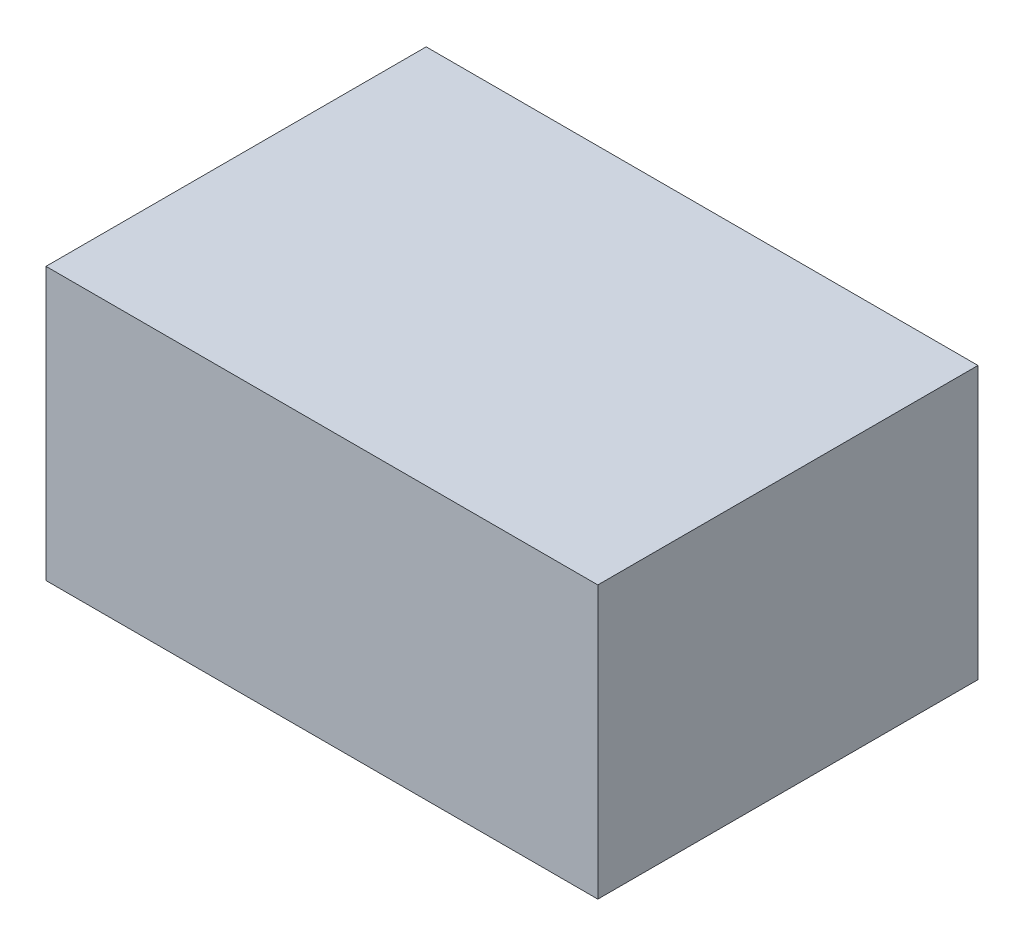
ISO-10303-21;
HEADER;
FILE_DESCRIPTION(('STEP AP214'),'2;1');
FILE_NAME('part.step','',(''),(''),'','','');
FILE_SCHEMA(('AUTOMOTIVE_DESIGN { 1 0 10303 214 1 1 1 1 }'));
ENDSEC;
DATA;
#1=APPLICATION_CONTEXT('core data for automotive mechanical design processes');
#2=APPLICATION_PROTOCOL_DEFINITION('international standard','automotive_design',2000,#1);
#3=PRODUCT_CONTEXT('',#1,'mechanical');
#4=PRODUCT('Part','Part','',(#3));
#5=PRODUCT_RELATED_PRODUCT_CATEGORY('part','',(#4));
#6=PRODUCT_DEFINITION_FORMATION('','',#4);
#7=PRODUCT_DEFINITION_CONTEXT('part definition',#1,'design');
#8=PRODUCT_DEFINITION('design','',#6,#7);
#9=PRODUCT_DEFINITION_SHAPE('','',#8);
#10=(LENGTH_UNIT() NAMED_UNIT(*) SI_UNIT(.MILLI.,.METRE.));
#11=(NAMED_UNIT(*) PLANE_ANGLE_UNIT() SI_UNIT($,.RADIAN.));
#12=(NAMED_UNIT(*) SI_UNIT($,.STERADIAN.) SOLID_ANGLE_UNIT());
#13=UNCERTAINTY_MEASURE_WITH_UNIT(LENGTH_MEASURE(1.E-05),#10,'distance_accuracy_value','');
#14=(GEOMETRIC_REPRESENTATION_CONTEXT(3) GLOBAL_UNCERTAINTY_ASSIGNED_CONTEXT((#13)) GLOBAL_UNIT_ASSIGNED_CONTEXT((#10,
#11,#12)) REPRESENTATION_CONTEXT('',''));
#15=CARTESIAN_POINT('',(0.,0.,0.));
#16=DIRECTION('',(0.,0.,1.));
#17=DIRECTION('',(1.,0.,0.));
#18=AXIS2_PLACEMENT_3D('',#15,#16,#17);
#19=CARTESIAN_POINT('',(0.91250008,-0.4499991,0.));
#20=DIRECTION('',(0.,-1.,0.));
#21=DIRECTION('',(0.,0.,-1.));
#22=AXIS2_PLACEMENT_3D('',#19,#20,#21);
#23=PLANE('',#22);
#24=DIRECTION('',(0.,0.,1.));
#25=VECTOR('',#24,1.);
#26=CARTESIAN_POINT('',(-0.91250008,-0.4499991,0.));
#27=LINE('',#26,#25);
#28=CARTESIAN_POINT('',(-0.91250008,-0.4499991,0.));
#29=VERTEX_POINT('',#28);
#30=CARTESIAN_POINT('',(-0.91250008,-0.4499991,1.2573));
#31=VERTEX_POINT('',#30);
#32=EDGE_CURVE('E19',#29,#31,#27,.T.);
#33=ORIENTED_EDGE('',*,*,#32,.F.);
#34=DIRECTION('',(1.,0.,0.));
#35=VECTOR('',#34,1.);
#36=CARTESIAN_POINT('',(-0.91250008,-0.4499991,0.));
#37=LINE('',#36,#35);
#38=CARTESIAN_POINT('',(0.91250008,-0.4499991,0.));
#39=VERTEX_POINT('',#38);
#40=EDGE_CURVE('E78',#29,#39,#37,.T.);
#41=ORIENTED_EDGE('',*,*,#40,.T.);
#42=DIRECTION('',(0.,0.,-1.));
#43=VECTOR('',#42,1.);
#44=CARTESIAN_POINT('',(0.91250008,-0.4499991,0.));
#45=LINE('',#44,#43);
#46=CARTESIAN_POINT('',(0.91250008,-0.4499991,1.2573));
#47=VERTEX_POINT('',#46);
#48=EDGE_CURVE('E60',#47,#39,#45,.T.);
#49=ORIENTED_EDGE('',*,*,#48,.F.);
#50=DIRECTION('',(1.,0.,0.));
#51=VECTOR('',#50,1.);
#52=CARTESIAN_POINT('',(-0.91250008,-0.4499991,1.2573));
#53=LINE('',#52,#51);
#54=EDGE_CURVE('E55',#31,#47,#53,.T.);
#55=ORIENTED_EDGE('',*,*,#54,.F.);
#56=EDGE_LOOP('',(#33,#41,#49,#55));
#57=FACE_BOUND('',#56,.T.);
#58=ADVANCED_FACE('F16',(#57),#23,.T.);
#59=CARTESIAN_POINT('',(-0.91250008,-0.4499991,0.));
#60=DIRECTION('',(-1.,0.,0.));
#61=DIRECTION('',(0.,0.,1.));
#62=AXIS2_PLACEMENT_3D('',#59,#60,#61);
#63=PLANE('',#62);
#64=DIRECTION('',(0.,0.,1.));
#65=VECTOR('',#64,1.);
#66=CARTESIAN_POINT('',(-0.91250008,0.45000164,0.));
#67=LINE('',#66,#65);
#68=CARTESIAN_POINT('',(-0.91250008,0.45000164,0.));
#69=VERTEX_POINT('',#68);
#70=CARTESIAN_POINT('',(-0.91250008,0.45000164,1.2573));
#71=VERTEX_POINT('',#70);
#72=EDGE_CURVE('E82',#69,#71,#67,.T.);
#73=ORIENTED_EDGE('',*,*,#72,.F.);
#74=DIRECTION('',(0.,1.,0.));
#75=VECTOR('',#74,1.);
#76=CARTESIAN_POINT('',(-0.91250008,-0.4499991,0.));
#77=LINE('',#76,#75);
#78=EDGE_CURVE('E67',#69,#29,#77,.F.);
#79=ORIENTED_EDGE('',*,*,#78,.T.);
#80=ORIENTED_EDGE('',*,*,#32,.T.);
#81=DIRECTION('',(0.,1.,0.));
#82=VECTOR('',#81,1.);
#83=CARTESIAN_POINT('',(-0.91250008,-0.4499991,1.2573));
#84=LINE('',#83,#82);
#85=EDGE_CURVE('E62',#71,#31,#84,.F.);
#86=ORIENTED_EDGE('',*,*,#85,.F.);
#87=EDGE_LOOP('',(#73,#79,#80,#86));
#88=FACE_BOUND('',#87,.T.);
#89=ADVANCED_FACE('F64',(#88),#63,.T.);
#90=CARTESIAN_POINT('',(-0.91250008,-0.4499991,1.2573));
#91=DIRECTION('',(0.,0.,1.));
#92=DIRECTION('',(1.,0.,0.));
#93=AXIS2_PLACEMENT_3D('',#90,#91,#92);
#94=PLANE('',#93);
#95=DIRECTION('',(1.,0.,0.));
#96=VECTOR('',#95,1.);
#97=CARTESIAN_POINT('',(-0.91250008,0.45000164,1.2573));
#98=LINE('',#97,#96);
#99=CARTESIAN_POINT('',(0.91250008,0.45000164,1.2573));
#100=VERTEX_POINT('',#99);
#101=EDGE_CURVE('E71',#71,#100,#98,.T.);
#102=ORIENTED_EDGE('',*,*,#101,.F.);
#103=ORIENTED_EDGE('',*,*,#85,.T.);
#104=ORIENTED_EDGE('',*,*,#54,.T.);
#105=DIRECTION('',(0.,1.,0.));
#106=VECTOR('',#105,1.);
#107=CARTESIAN_POINT('',(0.91250008,0.45000164,1.2573));
#108=LINE('',#107,#106);
#109=EDGE_CURVE('E73',#100,#47,#108,.F.);
#110=ORIENTED_EDGE('',*,*,#109,.F.);
#111=EDGE_LOOP('',(#102,#103,#104,#110));
#112=FACE_BOUND('',#111,.T.);
#113=ADVANCED_FACE('F69',(#112),#94,.T.);
#114=CARTESIAN_POINT('',(0.91250008,0.45000164,0.));
#115=DIRECTION('',(1.,0.,0.));
#116=DIRECTION('',(0.,0.,-1.));
#117=AXIS2_PLACEMENT_3D('',#114,#115,#116);
#118=PLANE('',#117);
#119=ORIENTED_EDGE('',*,*,#48,.T.);
#120=DIRECTION('',(0.,1.,0.));
#121=VECTOR('',#120,1.);
#122=CARTESIAN_POINT('',(0.91250008,-0.4499991,0.));
#123=LINE('',#122,#121);
#124=CARTESIAN_POINT('',(0.91250008,0.45000164,0.));
#125=VERTEX_POINT('',#124);
#126=EDGE_CURVE('E34',#39,#125,#123,.T.);
#127=ORIENTED_EDGE('',*,*,#126,.T.);
#128=DIRECTION('',(0.,0.,1.));
#129=VECTOR('',#128,1.);
#130=CARTESIAN_POINT('',(0.91250008,0.45000164,0.));
#131=LINE('',#130,#129);
#132=EDGE_CURVE('E25',#100,#125,#131,.F.);
#133=ORIENTED_EDGE('',*,*,#132,.F.);
#134=ORIENTED_EDGE('',*,*,#109,.T.);
#135=EDGE_LOOP('',(#119,#127,#133,#134));
#136=FACE_BOUND('',#135,.T.);
#137=ADVANCED_FACE('F88',(#136),#118,.T.);
#138=CARTESIAN_POINT('',(-0.91250008,-0.4499991,0.));
#139=DIRECTION('',(0.,0.,1.));
#140=DIRECTION('',(1.,0.,0.));
#141=AXIS2_PLACEMENT_3D('',#138,#139,#140);
#142=PLANE('',#141);
#143=DIRECTION('',(1.,0.,0.));
#144=VECTOR('',#143,1.);
#145=CARTESIAN_POINT('',(-0.91250008,0.45000164,0.));
#146=LINE('',#145,#144);
#147=EDGE_CURVE('E11',#125,#69,#146,.F.);
#148=ORIENTED_EDGE('',*,*,#147,.F.);
#149=ORIENTED_EDGE('',*,*,#126,.F.);
#150=ORIENTED_EDGE('',*,*,#40,.F.);
#151=ORIENTED_EDGE('',*,*,#78,.F.);
#152=EDGE_LOOP('',(#148,#149,#150,#151));
#153=FACE_BOUND('',#152,.T.);
#154=ADVANCED_FACE('F90',(#153),#142,.F.);
#155=CARTESIAN_POINT('',(-0.91250008,0.45000164,0.));
#156=DIRECTION('',(0.,1.,0.));
#157=DIRECTION('',(0.,0.,1.));
#158=AXIS2_PLACEMENT_3D('',#155,#156,#157);
#159=PLANE('',#158);
#160=ORIENTED_EDGE('',*,*,#132,.T.);
#161=ORIENTED_EDGE('',*,*,#147,.T.);
#162=ORIENTED_EDGE('',*,*,#72,.T.);
#163=ORIENTED_EDGE('',*,*,#101,.T.);
#164=EDGE_LOOP('',(#160,#161,#162,#163));
#165=FACE_BOUND('',#164,.T.);
#166=ADVANCED_FACE('F87',(#165),#159,.T.);
#167=CLOSED_SHELL('',(#58,#89,#113,#137,#154,#166));
#168=MANIFOLD_SOLID_BREP('B1',#167);
#169=ADVANCED_BREP_SHAPE_REPRESENTATION('',(#18,#168),#14);
#170=SHAPE_DEFINITION_REPRESENTATION(#9,#169);
ENDSEC;
END-ISO-10303-21;
